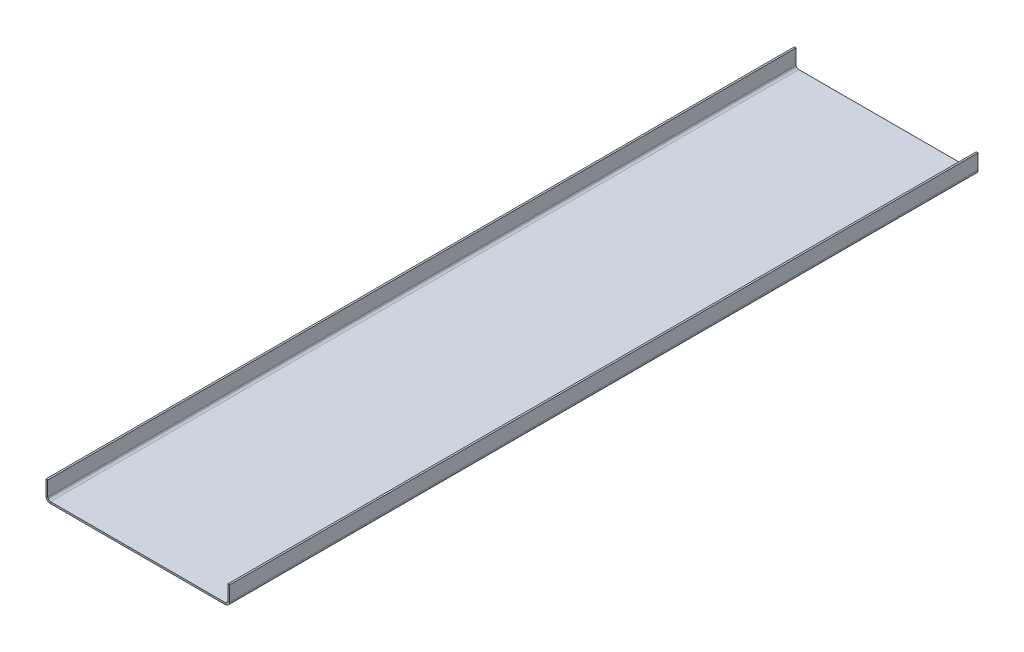
ISO-10303-21;
HEADER;
FILE_DESCRIPTION(('STEP AP214'),'2;1');
FILE_NAME('part.step','',(''),(''),'','','');
FILE_SCHEMA(('AUTOMOTIVE_DESIGN { 1 0 10303 214 1 1 1 1 }'));
ENDSEC;
DATA;
#1=APPLICATION_CONTEXT('core data for automotive mechanical design processes');
#2=APPLICATION_PROTOCOL_DEFINITION('international standard','automotive_design',2000,#1);
#3=PRODUCT_CONTEXT('',#1,'mechanical');
#4=PRODUCT('Part','Part','',(#3));
#5=PRODUCT_RELATED_PRODUCT_CATEGORY('part','',(#4));
#6=PRODUCT_DEFINITION_FORMATION('','',#4);
#7=PRODUCT_DEFINITION_CONTEXT('part definition',#1,'design');
#8=PRODUCT_DEFINITION('design','',#6,#7);
#9=PRODUCT_DEFINITION_SHAPE('','',#8);
#10=(LENGTH_UNIT() NAMED_UNIT(*) SI_UNIT(.MILLI.,.METRE.));
#11=(NAMED_UNIT(*) PLANE_ANGLE_UNIT() SI_UNIT($,.RADIAN.));
#12=(NAMED_UNIT(*) SI_UNIT($,.STERADIAN.) SOLID_ANGLE_UNIT());
#13=UNCERTAINTY_MEASURE_WITH_UNIT(LENGTH_MEASURE(1.E-05),#10,'distance_accuracy_value','');
#14=(GEOMETRIC_REPRESENTATION_CONTEXT(3) GLOBAL_UNCERTAINTY_ASSIGNED_CONTEXT((#13)) GLOBAL_UNIT_ASSIGNED_CONTEXT((#10,
#11,#12)) REPRESENTATION_CONTEXT('',''));
#15=CARTESIAN_POINT('',(0.,0.,0.));
#16=DIRECTION('',(0.,0.,1.));
#17=DIRECTION('',(1.,0.,0.));
#18=AXIS2_PLACEMENT_3D('',#15,#16,#17);
#19=CARTESIAN_POINT('',(100.,-2.,-428.));
#20=DIRECTION('',(0.,0.,-1.));
#21=DIRECTION('',(-1.,0.,0.));
#22=AXIS2_PLACEMENT_3D('',#19,#20,#21);
#23=PLANE('',#22);
#24=DIRECTION('',(-1.,0.,0.));
#25=VECTOR('',#24,1.);
#26=CARTESIAN_POINT('',(100.,0.,-428.));
#27=LINE('',#26,#25);
#28=CARTESIAN_POINT('',(100.,0.,-428.));
#29=VERTEX_POINT('',#28);
#30=CARTESIAN_POINT('',(-100.,0.,-428.));
#31=VERTEX_POINT('',#30);
#32=EDGE_CURVE('E117',#29,#31,#27,.T.);
#33=ORIENTED_EDGE('',*,*,#32,.F.);
#34=DIRECTION('',(0.,1.,0.));
#35=VECTOR('',#34,1.);
#36=CARTESIAN_POINT('',(100.,-2.,-428.));
#37=LINE('',#36,#35);
#38=CARTESIAN_POINT('',(100.,-2.00000000000001,-428.));
#39=VERTEX_POINT('',#38);
#40=EDGE_CURVE('E85',#39,#29,#37,.T.);
#41=ORIENTED_EDGE('',*,*,#40,.F.);
#42=DIRECTION('',(-1.,0.,0.));
#43=VECTOR('',#42,1.);
#44=CARTESIAN_POINT('',(100.,-2.,-428.));
#45=LINE('',#44,#43);
#46=CARTESIAN_POINT('',(-100.,-2.,-428.));
#47=VERTEX_POINT('',#46);
#48=EDGE_CURVE('E119',#39,#47,#45,.T.);
#49=ORIENTED_EDGE('',*,*,#48,.T.);
#50=DIRECTION('',(0.,1.,0.));
#51=VECTOR('',#50,1.);
#52=CARTESIAN_POINT('',(-100.,-2.,-428.));
#53=LINE('',#52,#51);
#54=EDGE_CURVE('E13',#47,#31,#53,.T.);
#55=ORIENTED_EDGE('',*,*,#54,.T.);
#56=EDGE_LOOP('',(#33,#41,#49,#55));
#57=FACE_BOUND('',#56,.T.);
#58=ADVANCED_FACE('F75',(#57),#23,.T.);
#59=CARTESIAN_POINT('',(100.,-2.,428.));
#60=DIRECTION('',(0.,0.,1.));
#61=DIRECTION('',(1.,0.,0.));
#62=AXIS2_PLACEMENT_3D('',#59,#60,#61);
#63=PLANE('',#62);
#64=DIRECTION('',(1.,0.,0.));
#65=VECTOR('',#64,1.);
#66=CARTESIAN_POINT('',(100.,0.,428.));
#67=LINE('',#66,#65);
#68=CARTESIAN_POINT('',(-100.,0.,428.));
#69=VERTEX_POINT('',#68);
#70=CARTESIAN_POINT('',(100.,0.,428.));
#71=VERTEX_POINT('',#70);
#72=EDGE_CURVE('E140',#69,#71,#67,.T.);
#73=ORIENTED_EDGE('',*,*,#72,.F.);
#74=DIRECTION('',(0.,1.,0.));
#75=VECTOR('',#74,1.);
#76=CARTESIAN_POINT('',(-100.,-2.,428.));
#77=LINE('',#76,#75);
#78=CARTESIAN_POINT('',(-100.,-1.99999999999999,428.));
#79=VERTEX_POINT('',#78);
#80=EDGE_CURVE('E79',#79,#69,#77,.T.);
#81=ORIENTED_EDGE('',*,*,#80,.F.);
#82=DIRECTION('',(1.,0.,0.));
#83=VECTOR('',#82,1.);
#84=CARTESIAN_POINT('',(100.,-2.,428.));
#85=LINE('',#84,#83);
#86=CARTESIAN_POINT('',(100.,-2.,428.));
#87=VERTEX_POINT('',#86);
#88=EDGE_CURVE('E204',#79,#87,#85,.T.);
#89=ORIENTED_EDGE('',*,*,#88,.T.);
#90=DIRECTION('',(0.,1.,0.));
#91=VECTOR('',#90,1.);
#92=CARTESIAN_POINT('',(100.,-2.,428.));
#93=LINE('',#92,#91);
#94=EDGE_CURVE('E213',#87,#71,#93,.T.);
#95=ORIENTED_EDGE('',*,*,#94,.T.);
#96=EDGE_LOOP('',(#73,#81,#89,#95));
#97=FACE_BOUND('',#96,.T.);
#98=ADVANCED_FACE('F77',(#97),#63,.T.);
#99=CARTESIAN_POINT('',(0.,-2.,0.));
#100=DIRECTION('',(0.,1.,0.));
#101=DIRECTION('',(0.,0.,1.));
#102=AXIS2_PLACEMENT_3D('',#99,#100,#101);
#103=PLANE('',#102);
#104=DIRECTION('',(0.,0.,1.));
#105=VECTOR('',#104,1.);
#106=CARTESIAN_POINT('',(-100.,-2.,428.));
#107=LINE('',#106,#105);
#108=EDGE_CURVE('E94',#47,#79,#107,.T.);
#109=ORIENTED_EDGE('',*,*,#108,.F.);
#110=ORIENTED_EDGE('',*,*,#48,.F.);
#111=DIRECTION('',(0.,0.,-1.));
#112=VECTOR('',#111,1.);
#113=CARTESIAN_POINT('',(100.,-2.,428.));
#114=LINE('',#113,#112);
#115=EDGE_CURVE('E207',#87,#39,#114,.T.);
#116=ORIENTED_EDGE('',*,*,#115,.F.);
#117=ORIENTED_EDGE('',*,*,#88,.F.);
#118=EDGE_LOOP('',(#109,#110,#116,#117));
#119=FACE_BOUND('',#118,.T.);
#120=ADVANCED_FACE('F343',(#119),#103,.F.);
#121=CARTESIAN_POINT('',(0.,0.,0.));
#122=DIRECTION('',(0.,1.,0.));
#123=DIRECTION('',(0.,0.,1.));
#124=AXIS2_PLACEMENT_3D('',#121,#122,#123);
#125=PLANE('',#124);
#126=DIRECTION('',(0.,0.,1.));
#127=VECTOR('',#126,1.);
#128=CARTESIAN_POINT('',(-100.,0.,428.));
#129=LINE('',#128,#127);
#130=EDGE_CURVE('E127',#31,#69,#129,.T.);
#131=ORIENTED_EDGE('',*,*,#130,.T.);
#132=ORIENTED_EDGE('',*,*,#72,.T.);
#133=DIRECTION('',(0.,0.,-1.));
#134=VECTOR('',#133,1.);
#135=CARTESIAN_POINT('',(100.,0.,428.));
#136=LINE('',#135,#134);
#137=EDGE_CURVE('E112',#71,#29,#136,.T.);
#138=ORIENTED_EDGE('',*,*,#137,.T.);
#139=ORIENTED_EDGE('',*,*,#32,.T.);
#140=EDGE_LOOP('',(#131,#132,#138,#139));
#141=FACE_BOUND('',#140,.T.);
#142=ADVANCED_FACE('F126',(#141),#125,.T.);
#143=CARTESIAN_POINT('',(100.,2.99999999999999,428.));
#144=DIRECTION('',(0.,0.,1.));
#145=DIRECTION('',(1.,0.,0.));
#146=AXIS2_PLACEMENT_3D('',#143,#144,#145);
#147=PLANE('',#146);
#148=DIRECTION('',(-1.,0.,0.));
#149=VECTOR('',#148,1.);
#150=CARTESIAN_POINT('',(105.,2.99999999999998,428.));
#151=LINE('',#150,#149);
#152=CARTESIAN_POINT('',(103.,2.99999999999998,428.));
#153=VERTEX_POINT('',#152);
#154=CARTESIAN_POINT('',(105.,2.99999999999998,428.));
#155=VERTEX_POINT('',#154);
#156=EDGE_CURVE('E190',#153,#155,#151,.F.);
#157=ORIENTED_EDGE('',*,*,#156,.F.);
#158=CARTESIAN_POINT('',(100.,2.99999999999999,428.));
#159=DIRECTION('',(0.,0.,-1.));
#160=DIRECTION('',(-1.,0.,0.));
#161=AXIS2_PLACEMENT_3D('',#158,#159,#160);
#162=CIRCLE('',#161,3.);
#163=EDGE_CURVE('E198',#71,#153,#162,.F.);
#164=ORIENTED_EDGE('',*,*,#163,.F.);
#165=ORIENTED_EDGE('',*,*,#94,.F.);
#166=CARTESIAN_POINT('',(100.,2.99999999999999,428.));
#167=DIRECTION('',(0.,0.,-1.));
#168=DIRECTION('',(-1.,0.,0.));
#169=AXIS2_PLACEMENT_3D('',#166,#167,#168);
#170=CIRCLE('',#169,5.);
#171=EDGE_CURVE('E141',#87,#155,#170,.F.);
#172=ORIENTED_EDGE('',*,*,#171,.T.);
#173=EDGE_LOOP('',(#157,#164,#165,#172));
#174=FACE_BOUND('',#173,.T.);
#175=ADVANCED_FACE('F335',(#174),#147,.T.);
#176=CARTESIAN_POINT('',(100.,2.99999999999999,-428.));
#177=DIRECTION('',(0.,0.,1.));
#178=DIRECTION('',(1.,0.,0.));
#179=AXIS2_PLACEMENT_3D('',#176,#177,#178);
#180=PLANE('',#179);
#181=CARTESIAN_POINT('',(100.,2.99999999999999,-428.));
#182=DIRECTION('',(0.,0.,-1.));
#183=DIRECTION('',(-1.,0.,0.));
#184=AXIS2_PLACEMENT_3D('',#181,#182,#183);
#185=CIRCLE('',#184,3.);
#186=CARTESIAN_POINT('',(103.,2.99999999999998,-428.));
#187=VERTEX_POINT('',#186);
#188=EDGE_CURVE('E159',#187,#29,#185,.T.);
#189=ORIENTED_EDGE('',*,*,#188,.F.);
#190=DIRECTION('',(-1.,0.,0.));
#191=VECTOR('',#190,1.);
#192=CARTESIAN_POINT('',(103.,2.99999999999998,-428.));
#193=LINE('',#192,#191);
#194=CARTESIAN_POINT('',(105.,2.99999999999997,-428.));
#195=VERTEX_POINT('',#194);
#196=EDGE_CURVE('E184',#187,#195,#193,.F.);
#197=ORIENTED_EDGE('',*,*,#196,.T.);
#198=CARTESIAN_POINT('',(100.,2.99999999999999,-428.));
#199=DIRECTION('',(0.,0.,-1.));
#200=DIRECTION('',(-1.,0.,0.));
#201=AXIS2_PLACEMENT_3D('',#198,#199,#200);
#202=CIRCLE('',#201,5.);
#203=EDGE_CURVE('E195',#195,#39,#202,.T.);
#204=ORIENTED_EDGE('',*,*,#203,.T.);
#205=ORIENTED_EDGE('',*,*,#40,.T.);
#206=EDGE_LOOP('',(#189,#197,#204,#205));
#207=FACE_BOUND('',#206,.T.);
#208=ADVANCED_FACE('F314',(#207),#180,.F.);
#209=CARTESIAN_POINT('',(100.,2.99999999999999,-428.));
#210=DIRECTION('',(0.,0.,-1.));
#211=DIRECTION('',(1.,0.,0.));
#212=AXIS2_PLACEMENT_3D('',#209,#210,#211);
#213=CYLINDRICAL_SURFACE('',#212,5.);
#214=ORIENTED_EDGE('',*,*,#115,.T.);
#215=ORIENTED_EDGE('',*,*,#203,.F.);
#216=DIRECTION('',(0.,0.,-1.));
#217=VECTOR('',#216,1.);
#218=CARTESIAN_POINT('',(105.,2.99999999999998,428.));
#219=LINE('',#218,#217);
#220=EDGE_CURVE('E181',#195,#155,#219,.F.);
#221=ORIENTED_EDGE('',*,*,#220,.T.);
#222=ORIENTED_EDGE('',*,*,#171,.F.);
#223=EDGE_LOOP('',(#214,#215,#221,#222));
#224=FACE_BOUND('',#223,.T.);
#225=ADVANCED_FACE('F333',(#224),#213,.T.);
#226=CARTESIAN_POINT('',(100.,2.99999999999999,-428.));
#227=DIRECTION('',(0.,0.,-1.));
#228=DIRECTION('',(1.,0.,0.));
#229=AXIS2_PLACEMENT_3D('',#226,#227,#228);
#230=CYLINDRICAL_SURFACE('',#229,3.);
#231=ORIENTED_EDGE('',*,*,#137,.F.);
#232=ORIENTED_EDGE('',*,*,#163,.T.);
#233=DIRECTION('',(0.,0.,-1.));
#234=VECTOR('',#233,1.);
#235=CARTESIAN_POINT('',(103.,2.99999999999999,428.));
#236=LINE('',#235,#234);
#237=EDGE_CURVE('E187',#153,#187,#236,.T.);
#238=ORIENTED_EDGE('',*,*,#237,.T.);
#239=ORIENTED_EDGE('',*,*,#188,.T.);
#240=EDGE_LOOP('',(#231,#232,#238,#239));
#241=FACE_BOUND('',#240,.T.);
#242=ADVANCED_FACE('F307',(#241),#230,.F.);
#243=CARTESIAN_POINT('',(105.,20.,-428.));
#244=DIRECTION('',(0.,0.,1.));
#245=DIRECTION('',(1.,0.,0.));
#246=AXIS2_PLACEMENT_3D('',#243,#244,#245);
#247=PLANE('',#246);
#248=ORIENTED_EDGE('',*,*,#196,.F.);
#249=DIRECTION('',(0.,-1.,0.));
#250=VECTOR('',#249,1.);
#251=CARTESIAN_POINT('',(103.,20.,-428.));
#252=LINE('',#251,#250);
#253=CARTESIAN_POINT('',(103.,20.,-428.));
#254=VERTEX_POINT('',#253);
#255=EDGE_CURVE('E178',#187,#254,#252,.F.);
#256=ORIENTED_EDGE('',*,*,#255,.T.);
#257=DIRECTION('',(-1.,0.,0.));
#258=VECTOR('',#257,1.);
#259=CARTESIAN_POINT('',(105.,20.,-428.));
#260=LINE('',#259,#258);
#261=CARTESIAN_POINT('',(105.,20.,-428.));
#262=VERTEX_POINT('',#261);
#263=EDGE_CURVE('E156',#262,#254,#260,.T.);
#264=ORIENTED_EDGE('',*,*,#263,.F.);
#265=DIRECTION('',(0.,1.,0.));
#266=VECTOR('',#265,1.);
#267=CARTESIAN_POINT('',(105.,-3.53927657873048E-13,-428.));
#268=LINE('',#267,#266);
#269=EDGE_CURVE('E169',#195,#262,#268,.T.);
#270=ORIENTED_EDGE('',*,*,#269,.F.);
#271=EDGE_LOOP('',(#248,#256,#264,#270));
#272=FACE_BOUND('',#271,.T.);
#273=ADVANCED_FACE('F318',(#272),#247,.F.);
#274=CARTESIAN_POINT('',(105.,0.,428.));
#275=DIRECTION('',(0.,0.,-1.));
#276=DIRECTION('',(-1.,0.,0.));
#277=AXIS2_PLACEMENT_3D('',#274,#275,#276);
#278=PLANE('',#277);
#279=ORIENTED_EDGE('',*,*,#156,.T.);
#280=DIRECTION('',(0.,-1.,0.));
#281=VECTOR('',#280,1.);
#282=CARTESIAN_POINT('',(105.,-3.53927657873048E-13,428.));
#283=LINE('',#282,#281);
#284=CARTESIAN_POINT('',(105.,20.,428.));
#285=VERTEX_POINT('',#284);
#286=EDGE_CURVE('E163',#285,#155,#283,.T.);
#287=ORIENTED_EDGE('',*,*,#286,.F.);
#288=DIRECTION('',(-1.,0.,0.));
#289=VECTOR('',#288,1.);
#290=CARTESIAN_POINT('',(105.,20.,428.));
#291=LINE('',#290,#289);
#292=CARTESIAN_POINT('',(103.,20.,428.));
#293=VERTEX_POINT('',#292);
#294=EDGE_CURVE('E160',#285,#293,#291,.T.);
#295=ORIENTED_EDGE('',*,*,#294,.T.);
#296=DIRECTION('',(0.,1.,0.));
#297=VECTOR('',#296,1.);
#298=CARTESIAN_POINT('',(103.,0.,428.));
#299=LINE('',#298,#297);
#300=EDGE_CURVE('E172',#293,#153,#299,.F.);
#301=ORIENTED_EDGE('',*,*,#300,.T.);
#302=EDGE_LOOP('',(#279,#287,#295,#301));
#303=FACE_BOUND('',#302,.T.);
#304=ADVANCED_FACE('F328',(#303),#278,.F.);
#305=CARTESIAN_POINT('',(105.,-3.53927657873048E-13,0.));
#306=DIRECTION('',(-1.,0.,0.));
#307=DIRECTION('',(0.,-1.,0.));
#308=AXIS2_PLACEMENT_3D('',#305,#306,#307);
#309=PLANE('',#308);
#310=ORIENTED_EDGE('',*,*,#220,.F.);
#311=ORIENTED_EDGE('',*,*,#269,.T.);
#312=DIRECTION('',(0.,0.,1.));
#313=VECTOR('',#312,1.);
#314=CARTESIAN_POINT('',(105.,20.,0.));
#315=LINE('',#314,#313);
#316=EDGE_CURVE('E166',#262,#285,#315,.T.);
#317=ORIENTED_EDGE('',*,*,#316,.T.);
#318=ORIENTED_EDGE('',*,*,#286,.T.);
#319=EDGE_LOOP('',(#310,#311,#317,#318));
#320=FACE_BOUND('',#319,.T.);
#321=ADVANCED_FACE('F330',(#320),#309,.F.);
#322=CARTESIAN_POINT('',(103.,-3.46944695195361E-13,0.));
#323=DIRECTION('',(-1.,0.,0.));
#324=DIRECTION('',(0.,-1.,0.));
#325=AXIS2_PLACEMENT_3D('',#322,#323,#324);
#326=PLANE('',#325);
#327=ORIENTED_EDGE('',*,*,#255,.F.);
#328=ORIENTED_EDGE('',*,*,#237,.F.);
#329=ORIENTED_EDGE('',*,*,#300,.F.);
#330=DIRECTION('',(0.,0.,-1.));
#331=VECTOR('',#330,1.);
#332=CARTESIAN_POINT('',(103.,20.,428.));
#333=LINE('',#332,#331);
#334=EDGE_CURVE('E175',#254,#293,#333,.F.);
#335=ORIENTED_EDGE('',*,*,#334,.F.);
#336=EDGE_LOOP('',(#327,#328,#329,#335));
#337=FACE_BOUND('',#336,.T.);
#338=ADVANCED_FACE('F321',(#337),#326,.T.);
#339=CARTESIAN_POINT('',(105.,20.,428.));
#340=DIRECTION('',(0.,-1.,0.));
#341=DIRECTION('',(1.,0.,0.));
#342=AXIS2_PLACEMENT_3D('',#339,#340,#341);
#343=PLANE('',#342);
#344=ORIENTED_EDGE('',*,*,#334,.T.);
#345=ORIENTED_EDGE('',*,*,#294,.F.);
#346=ORIENTED_EDGE('',*,*,#316,.F.);
#347=ORIENTED_EDGE('',*,*,#263,.T.);
#348=EDGE_LOOP('',(#344,#345,#346,#347));
#349=FACE_BOUND('',#348,.T.);
#350=ADVANCED_FACE('F324',(#349),#343,.F.);
#351=CARTESIAN_POINT('',(-100.,3.00000000000001,-428.));
#352=DIRECTION('',(0.,0.,-1.));
#353=DIRECTION('',(-1.,0.,0.));
#354=AXIS2_PLACEMENT_3D('',#351,#352,#353);
#355=PLANE('',#354);
#356=DIRECTION('',(1.,0.,0.));
#357=VECTOR('',#356,1.);
#358=CARTESIAN_POINT('',(-105.,2.99999999999998,-428.));
#359=LINE('',#358,#357);
#360=CARTESIAN_POINT('',(-103.,3.,-428.));
#361=VERTEX_POINT('',#360);
#362=CARTESIAN_POINT('',(-105.,3.,-428.));
#363=VERTEX_POINT('',#362);
#364=EDGE_CURVE('E146',#361,#363,#359,.F.);
#365=ORIENTED_EDGE('',*,*,#364,.F.);
#366=CARTESIAN_POINT('',(-100.,3.00000000000001,-428.));
#367=DIRECTION('',(0.,0.,1.));
#368=DIRECTION('',(1.,0.,0.));
#369=AXIS2_PLACEMENT_3D('',#366,#367,#368);
#370=CIRCLE('',#369,3.);
#371=EDGE_CURVE('E136',#31,#361,#370,.F.);
#372=ORIENTED_EDGE('',*,*,#371,.F.);
#373=ORIENTED_EDGE('',*,*,#54,.F.);
#374=CARTESIAN_POINT('',(-100.,3.00000000000001,-428.));
#375=DIRECTION('',(0.,0.,1.));
#376=DIRECTION('',(1.,0.,0.));
#377=AXIS2_PLACEMENT_3D('',#374,#375,#376);
#378=CIRCLE('',#377,5.);
#379=EDGE_CURVE('E150',#47,#363,#378,.F.);
#380=ORIENTED_EDGE('',*,*,#379,.T.);
#381=EDGE_LOOP('',(#365,#372,#373,#380));
#382=FACE_BOUND('',#381,.T.);
#383=ADVANCED_FACE('F144',(#382),#355,.T.);
#384=CARTESIAN_POINT('',(-100.,3.00000000000001,428.));
#385=DIRECTION('',(0.,0.,-1.));
#386=DIRECTION('',(-1.,0.,0.));
#387=AXIS2_PLACEMENT_3D('',#384,#385,#386);
#388=PLANE('',#387);
#389=CARTESIAN_POINT('',(-100.,3.00000000000001,428.));
#390=DIRECTION('',(0.,0.,1.));
#391=DIRECTION('',(1.,0.,0.));
#392=AXIS2_PLACEMENT_3D('',#389,#390,#391);
#393=CIRCLE('',#392,3.);
#394=CARTESIAN_POINT('',(-103.,3.,428.));
#395=VERTEX_POINT('',#394);
#396=EDGE_CURVE('E139',#395,#69,#393,.T.);
#397=ORIENTED_EDGE('',*,*,#396,.F.);
#398=DIRECTION('',(1.,0.,0.));
#399=VECTOR('',#398,1.);
#400=CARTESIAN_POINT('',(-103.,3.00000000000002,428.));
#401=LINE('',#400,#399);
#402=CARTESIAN_POINT('',(-105.,3.00000000000001,428.));
#403=VERTEX_POINT('',#402);
#404=EDGE_CURVE('E237',#395,#403,#401,.F.);
#405=ORIENTED_EDGE('',*,*,#404,.T.);
#406=CARTESIAN_POINT('',(-100.,3.00000000000001,428.));
#407=DIRECTION('',(0.,0.,1.));
#408=DIRECTION('',(1.,0.,0.));
#409=AXIS2_PLACEMENT_3D('',#406,#407,#408);
#410=CIRCLE('',#409,5.);
#411=EDGE_CURVE('E147',#403,#79,#410,.T.);
#412=ORIENTED_EDGE('',*,*,#411,.T.);
#413=ORIENTED_EDGE('',*,*,#80,.T.);
#414=EDGE_LOOP('',(#397,#405,#412,#413));
#415=FACE_BOUND('',#414,.T.);
#416=ADVANCED_FACE('F218',(#415),#388,.F.);
#417=CARTESIAN_POINT('',(-100.,3.00000000000001,428.));
#418=DIRECTION('',(0.,0.,1.));
#419=DIRECTION('',(-1.,0.,0.));
#420=AXIS2_PLACEMENT_3D('',#417,#418,#419);
#421=CYLINDRICAL_SURFACE('',#420,5.);
#422=ORIENTED_EDGE('',*,*,#108,.T.);
#423=ORIENTED_EDGE('',*,*,#411,.F.);
#424=DIRECTION('',(0.,0.,1.));
#425=VECTOR('',#424,1.);
#426=CARTESIAN_POINT('',(-105.,2.99999999999998,-428.));
#427=LINE('',#426,#425);
#428=EDGE_CURVE('E232',#403,#363,#427,.F.);
#429=ORIENTED_EDGE('',*,*,#428,.T.);
#430=ORIENTED_EDGE('',*,*,#379,.F.);
#431=EDGE_LOOP('',(#422,#423,#429,#430));
#432=FACE_BOUND('',#431,.T.);
#433=ADVANCED_FACE('F228',(#432),#421,.T.);
#434=CARTESIAN_POINT('',(-100.,3.00000000000001,428.));
#435=DIRECTION('',(0.,0.,1.));
#436=DIRECTION('',(-1.,0.,0.));
#437=AXIS2_PLACEMENT_3D('',#434,#435,#436);
#438=CYLINDRICAL_SURFACE('',#437,3.);
#439=ORIENTED_EDGE('',*,*,#130,.F.);
#440=ORIENTED_EDGE('',*,*,#371,.T.);
#441=DIRECTION('',(0.,0.,1.));
#442=VECTOR('',#441,1.);
#443=CARTESIAN_POINT('',(-103.,2.99999999999999,-428.));
#444=LINE('',#443,#442);
#445=EDGE_CURVE('E235',#361,#395,#444,.T.);
#446=ORIENTED_EDGE('',*,*,#445,.T.);
#447=ORIENTED_EDGE('',*,*,#396,.T.);
#448=EDGE_LOOP('',(#439,#440,#446,#447));
#449=FACE_BOUND('',#448,.T.);
#450=ADVANCED_FACE('F133',(#449),#438,.F.);
#451=CARTESIAN_POINT('',(-105.,0.,-428.));
#452=DIRECTION('',(0.,0.,1.));
#453=DIRECTION('',(1.,0.,0.));
#454=AXIS2_PLACEMENT_3D('',#451,#452,#453);
#455=PLANE('',#454);
#456=ORIENTED_EDGE('',*,*,#364,.T.);
#457=DIRECTION('',(0.,-1.,0.));
#458=VECTOR('',#457,1.);
#459=CARTESIAN_POINT('',(-105.,-3.53927657873048E-13,-428.));
#460=LINE('',#459,#458);
#461=CARTESIAN_POINT('',(-105.,20.,-428.));
#462=VERTEX_POINT('',#461);
#463=EDGE_CURVE('E249',#462,#363,#460,.T.);
#464=ORIENTED_EDGE('',*,*,#463,.F.);
#465=DIRECTION('',(1.,0.,0.));
#466=VECTOR('',#465,1.);
#467=CARTESIAN_POINT('',(-105.,20.,-428.));
#468=LINE('',#467,#466);
#469=CARTESIAN_POINT('',(-103.,20.,-428.));
#470=VERTEX_POINT('',#469);
#471=EDGE_CURVE('E258',#462,#470,#468,.T.);
#472=ORIENTED_EDGE('',*,*,#471,.T.);
#473=DIRECTION('',(0.,1.,0.));
#474=VECTOR('',#473,1.);
#475=CARTESIAN_POINT('',(-103.,0.,-428.));
#476=LINE('',#475,#474);
#477=EDGE_CURVE('E240',#470,#361,#476,.F.);
#478=ORIENTED_EDGE('',*,*,#477,.T.);
#479=EDGE_LOOP('',(#456,#464,#472,#478));
#480=FACE_BOUND('',#479,.T.);
#481=ADVANCED_FACE('F280',(#480),#455,.F.);
#482=CARTESIAN_POINT('',(-105.,20.,428.));
#483=DIRECTION('',(0.,0.,-1.));
#484=DIRECTION('',(-1.,0.,0.));
#485=AXIS2_PLACEMENT_3D('',#482,#483,#484);
#486=PLANE('',#485);
#487=ORIENTED_EDGE('',*,*,#404,.F.);
#488=DIRECTION('',(0.,-1.,0.));
#489=VECTOR('',#488,1.);
#490=CARTESIAN_POINT('',(-103.,20.,428.));
#491=LINE('',#490,#489);
#492=CARTESIAN_POINT('',(-103.,20.,428.));
#493=VERTEX_POINT('',#492);
#494=EDGE_CURVE('E243',#395,#493,#491,.F.);
#495=ORIENTED_EDGE('',*,*,#494,.T.);
#496=DIRECTION('',(1.,0.,0.));
#497=VECTOR('',#496,1.);
#498=CARTESIAN_POINT('',(-105.,20.,428.));
#499=LINE('',#498,#497);
#500=CARTESIAN_POINT('',(-105.,20.,428.));
#501=VERTEX_POINT('',#500);
#502=EDGE_CURVE('E152',#501,#493,#499,.T.);
#503=ORIENTED_EDGE('',*,*,#502,.F.);
#504=DIRECTION('',(0.,1.,0.));
#505=VECTOR('',#504,1.);
#506=CARTESIAN_POINT('',(-105.,-3.53927657873048E-13,428.));
#507=LINE('',#506,#505);
#508=EDGE_CURVE('E252',#403,#501,#507,.T.);
#509=ORIENTED_EDGE('',*,*,#508,.F.);
#510=EDGE_LOOP('',(#487,#495,#503,#509));
#511=FACE_BOUND('',#510,.T.);
#512=ADVANCED_FACE('F480',(#511),#486,.F.);
#513=CARTESIAN_POINT('',(-105.,-3.53927657873048E-13,0.));
#514=DIRECTION('',(1.,0.,0.));
#515=DIRECTION('',(0.,1.,0.));
#516=AXIS2_PLACEMENT_3D('',#513,#514,#515);
#517=PLANE('',#516);
#518=ORIENTED_EDGE('',*,*,#428,.F.);
#519=ORIENTED_EDGE('',*,*,#508,.T.);
#520=DIRECTION('',(0.,0.,-1.));
#521=VECTOR('',#520,1.);
#522=CARTESIAN_POINT('',(-105.,20.,0.));
#523=LINE('',#522,#521);
#524=EDGE_CURVE('E255',#501,#462,#523,.T.);
#525=ORIENTED_EDGE('',*,*,#524,.T.);
#526=ORIENTED_EDGE('',*,*,#463,.T.);
#527=EDGE_LOOP('',(#518,#519,#525,#526));
#528=FACE_BOUND('',#527,.T.);
#529=ADVANCED_FACE('F490',(#528),#517,.F.);
#530=CARTESIAN_POINT('',(-103.,-3.46944695195361E-13,0.));
#531=DIRECTION('',(1.,0.,0.));
#532=DIRECTION('',(0.,1.,0.));
#533=AXIS2_PLACEMENT_3D('',#530,#531,#532);
#534=PLANE('',#533);
#535=ORIENTED_EDGE('',*,*,#494,.F.);
#536=ORIENTED_EDGE('',*,*,#445,.F.);
#537=ORIENTED_EDGE('',*,*,#477,.F.);
#538=DIRECTION('',(0.,0.,1.));
#539=VECTOR('',#538,1.);
#540=CARTESIAN_POINT('',(-103.,20.,-428.));
#541=LINE('',#540,#539);
#542=EDGE_CURVE('E246',#493,#470,#541,.F.);
#543=ORIENTED_EDGE('',*,*,#542,.F.);
#544=EDGE_LOOP('',(#535,#536,#537,#543));
#545=FACE_BOUND('',#544,.T.);
#546=ADVANCED_FACE('F277',(#545),#534,.T.);
#547=CARTESIAN_POINT('',(-105.,20.,-428.));
#548=DIRECTION('',(0.,-1.,0.));
#549=DIRECTION('',(1.,0.,0.));
#550=AXIS2_PLACEMENT_3D('',#547,#548,#549);
#551=PLANE('',#550);
#552=ORIENTED_EDGE('',*,*,#542,.T.);
#553=ORIENTED_EDGE('',*,*,#471,.F.);
#554=ORIENTED_EDGE('',*,*,#524,.F.);
#555=ORIENTED_EDGE('',*,*,#502,.T.);
#556=EDGE_LOOP('',(#552,#553,#554,#555));
#557=FACE_BOUND('',#556,.T.);
#558=ADVANCED_FACE('F267',(#557),#551,.F.);
#559=CLOSED_SHELL('',(#58,#98,#120,#142,#175,#208,#225,#242,#273,#304,#321,#338,#350,#383,#416,
#433,#450,#481,#512,#529,#546,#558));
#560=MANIFOLD_SOLID_BREP('B2',#559);
#561=ADVANCED_BREP_SHAPE_REPRESENTATION('',(#18,#560),#14);
#562=SHAPE_DEFINITION_REPRESENTATION(#9,#561);
ENDSEC;
END-ISO-10303-21;
